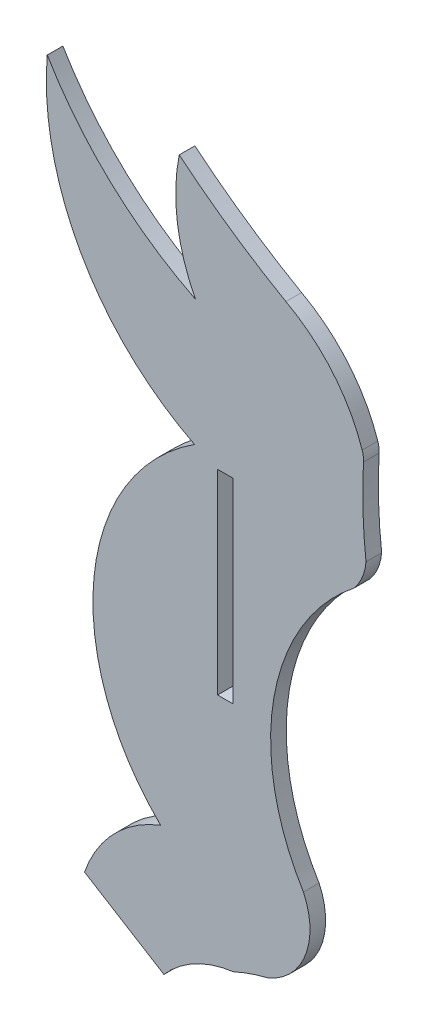
ISO-10303-21;
HEADER;
FILE_DESCRIPTION(('STEP AP214'),'2;1');
FILE_NAME('part.step','',(''),(''),'','','');
FILE_SCHEMA(('AUTOMOTIVE_DESIGN { 1 0 10303 214 1 1 1 1 }'));
ENDSEC;
DATA;
#1=APPLICATION_CONTEXT('core data for automotive mechanical design processes');
#2=APPLICATION_PROTOCOL_DEFINITION('international standard','automotive_design',2000,#1);
#3=PRODUCT_CONTEXT('',#1,'mechanical');
#4=PRODUCT('Part','Part','',(#3));
#5=PRODUCT_RELATED_PRODUCT_CATEGORY('part','',(#4));
#6=PRODUCT_DEFINITION_FORMATION('','',#4);
#7=PRODUCT_DEFINITION_CONTEXT('part definition',#1,'design');
#8=PRODUCT_DEFINITION('design','',#6,#7);
#9=PRODUCT_DEFINITION_SHAPE('','',#8);
#10=(LENGTH_UNIT() NAMED_UNIT(*) SI_UNIT(.MILLI.,.METRE.));
#11=(NAMED_UNIT(*) PLANE_ANGLE_UNIT() SI_UNIT($,.RADIAN.));
#12=(NAMED_UNIT(*) SI_UNIT($,.STERADIAN.) SOLID_ANGLE_UNIT());
#13=UNCERTAINTY_MEASURE_WITH_UNIT(LENGTH_MEASURE(1.E-05),#10,'distance_accuracy_value','');
#14=(GEOMETRIC_REPRESENTATION_CONTEXT(3) GLOBAL_UNCERTAINTY_ASSIGNED_CONTEXT((#13)) GLOBAL_UNIT_ASSIGNED_CONTEXT((#10,
#11,#12)) REPRESENTATION_CONTEXT('',''));
#15=CARTESIAN_POINT('',(0.,0.,0.));
#16=DIRECTION('',(0.,0.,1.));
#17=DIRECTION('',(1.,0.,0.));
#18=AXIS2_PLACEMENT_3D('',#15,#16,#17);
#19=CARTESIAN_POINT('',(9.55454090485293,-191.285070847435,1.524));
#20=DIRECTION('',(0.,0.,1.));
#21=DIRECTION('',(1.,0.,0.));
#22=AXIS2_PLACEMENT_3D('',#19,#20,#21);
#23=PLANE('',#22);
#24=CARTESIAN_POINT('',(9.55454090485293,-191.285070847435,1.524));
#25=DIRECTION('',(0.,0.,1.));
#26=DIRECTION('',(1.,0.,0.));
#27=AXIS2_PLACEMENT_3D('',#24,#25,#26);
#28=CIRCLE('',#27,21.7056422782127);
#29=CARTESIAN_POINT('',(-2.25421514068312,-173.072762169874,1.524));
#30=VERTEX_POINT('',#29);
#31=CARTESIAN_POINT('',(-5.54862103241916,-206.874471291527,1.524));
#32=VERTEX_POINT('',#31);
#33=EDGE_CURVE('E208',#30,#32,#28,.T.);
#34=ORIENTED_EDGE('',*,*,#33,.T.);
#35=CARTESIAN_POINT('',(-1.05625421100928,-218.650257011627,1.524));
#36=DIRECTION('',(0.,0.,1.));
#37=DIRECTION('',(1.,0.,0.));
#38=AXIS2_PLACEMENT_3D('',#35,#36,#37);
#39=CIRCLE('',#38,12.6035903211671);
#40=CARTESIAN_POINT('',(-12.9684016665908,-214.533069624551,1.524));
#41=VERTEX_POINT('',#40);
#42=EDGE_CURVE('E211',#32,#41,#39,.T.);
#43=ORIENTED_EDGE('',*,*,#42,.T.);
#44=DIRECTION('',(0.850986149629736,-0.525188131185728,0.));
#45=VECTOR('',#44,1.);
#46=CARTESIAN_POINT('',(-12.9684016665908,-214.533069624551,1.524));
#47=LINE('',#46,#45);
#48=CARTESIAN_POINT('',(-5.23100859896885,-219.308220203914,1.524));
#49=VERTEX_POINT('',#48);
#50=EDGE_CURVE('E214',#41,#49,#47,.T.);
#51=ORIENTED_EDGE('',*,*,#50,.T.);
#52=CARTESIAN_POINT('',(2.86907927883287,-226.347107534115,1.524));
#53=DIRECTION('',(0.,0.,-1.));
#54=DIRECTION('',(-1.,0.,0.));
#55=AXIS2_PLACEMENT_3D('',#52,#53,#54);
#56=CIRCLE('',#55,10.7311396633995);
#57=CARTESIAN_POINT('',(1.524,-215.700600115763,1.524));
#58=VERTEX_POINT('',#57);
#59=EDGE_CURVE('E216',#49,#58,#56,.T.);
#60=ORIENTED_EDGE('',*,*,#59,.T.);
#61=CARTESIAN_POINT('',(9.38357914118728,-232.915207817326,1.524));
#62=DIRECTION('',(0.,0.,-1.));
#63=DIRECTION('',(1.,0.,0.));
#64=AXIS2_PLACEMENT_3D('',#61,#62,#63);
#65=CIRCLE('',#64,18.9239452175096);
#66=CARTESIAN_POINT('',(4.91126657872368,-214.527328033649,1.524));
#67=VERTEX_POINT('',#66);
#68=EDGE_CURVE('E218',#58,#67,#65,.T.);
#69=ORIENTED_EDGE('',*,*,#68,.T.);
#70=CARTESIAN_POINT('',(2.37198795819861,-208.395239811144,1.524));
#71=DIRECTION('',(0.,0.,1.));
#72=DIRECTION('',(-1.,0.,0.));
#73=AXIS2_PLACEMENT_3D('',#70,#71,#72);
#74=CIRCLE('',#73,6.6370506914778);
#75=CARTESIAN_POINT('',(8.36625056807073,-205.545808702109,1.524));
#76=VERTEX_POINT('',#75);
#77=EDGE_CURVE('E220',#67,#76,#74,.T.);
#78=ORIENTED_EDGE('',*,*,#77,.T.);
#79=CARTESIAN_POINT('',(26.6766710158399,-194.264083119774,1.524));
#80=DIRECTION('',(0.,0.,-1.));
#81=DIRECTION('',(1.,0.,0.));
#82=AXIS2_PLACEMENT_3D('',#79,#80,#81);
#83=CIRCLE('',#82,21.5069483909083);
#84=CARTESIAN_POINT('',(13.311403321465,-177.414203341364,1.524));
#85=VERTEX_POINT('',#84);
#86=EDGE_CURVE('E222',#76,#85,#83,.T.);
#87=ORIENTED_EDGE('',*,*,#86,.T.);
#88=CARTESIAN_POINT('',(9.55284362416045,-174.220966814507,1.524));
#89=DIRECTION('',(0.,0.,1.));
#90=DIRECTION('',(-1.,0.,0.));
#91=AXIS2_PLACEMENT_3D('',#88,#89,#90);
#92=CIRCLE('',#91,4.93188914257543);
#93=CARTESIAN_POINT('',(14.4684042680743,-174.621958174337,1.524));
#94=VERTEX_POINT('',#93);
#95=EDGE_CURVE('E224',#85,#94,#92,.T.);
#96=ORIENTED_EDGE('',*,*,#95,.T.);
#97=CARTESIAN_POINT('',(63.0675660835449,-169.034269570961,1.524));
#98=DIRECTION('',(0.,0.,-1.));
#99=DIRECTION('',(1.,0.,0.));
#100=AXIS2_PLACEMENT_3D('',#97,#98,#99);
#101=CIRCLE('',#100,48.9193294424054);
#102=CARTESIAN_POINT('',(14.2231544027315,-166.327936138102,1.524));
#103=VERTEX_POINT('',#102);
#104=EDGE_CURVE('E226',#94,#103,#101,.T.);
#105=ORIENTED_EDGE('',*,*,#104,.T.);
#106=CARTESIAN_POINT('',(11.6870442989508,-166.187417308476,1.524));
#107=DIRECTION('',(0.,0.,1.));
#108=DIRECTION('',(1.,0.,0.));
#109=AXIS2_PLACEMENT_3D('',#106,#107,#108);
#110=CIRCLE('',#109,2.53999999999569);
#111=CARTESIAN_POINT('',(14.0945005026069,-165.377630529468,1.524));
#112=VERTEX_POINT('',#111);
#113=EDGE_CURVE('E228',#103,#112,#110,.T.);
#114=ORIENTED_EDGE('',*,*,#113,.T.);
#115=CARTESIAN_POINT('',(-0.795742059192087,-170.38620412032,1.524));
#116=DIRECTION('',(0.,0.,1.));
#117=DIRECTION('',(-1.,0.,0.));
#118=AXIS2_PLACEMENT_3D('',#115,#116,#117);
#119=CIRCLE('',#118,15.7100328759741);
#120=CARTESIAN_POINT('',(6.66463399306851,-156.560578560402,1.524));
#121=VERTEX_POINT('',#120);
#122=EDGE_CURVE('E230',#112,#121,#119,.T.);
#123=ORIENTED_EDGE('',*,*,#122,.T.);
#124=CARTESIAN_POINT('',(43.2467626277982,-92.4867373333111,1.524));
#125=DIRECTION('',(0.,0.,-1.));
#126=DIRECTION('',(1.,0.,0.));
#127=AXIS2_PLACEMENT_3D('',#124,#125,#126);
#128=CIRCLE('',#127,73.7814967660752);
#129=CARTESIAN_POINT('',(-3.73848602777618,-149.373428868469,1.524));
#130=VERTEX_POINT('',#129);
#131=EDGE_CURVE('E232',#121,#130,#128,.T.);
#132=ORIENTED_EDGE('',*,*,#131,.T.);
#133=CARTESIAN_POINT('',(13.3536544556553,-152.814995018638,1.524));
#134=DIRECTION('',(0.,0.,1.));
#135=DIRECTION('',(-1.,0.,0.));
#136=AXIS2_PLACEMENT_3D('',#133,#134,#135);
#137=CIRCLE('',#136,17.4351840790783);
#138=CARTESIAN_POINT('',(-2.16496753200634,-160.762196757326,1.524));
#139=VERTEX_POINT('',#138);
#140=EDGE_CURVE('E234',#130,#139,#137,.T.);
#141=ORIENTED_EDGE('',*,*,#140,.T.);
#142=CARTESIAN_POINT('',(13.3465831148694,-129.548919544681,1.524));
#143=DIRECTION('',(0.,0.,-1.));
#144=DIRECTION('',(1.,0.,0.));
#145=AXIS2_PLACEMENT_3D('',#142,#143,#144);
#146=CIRCLE('',#145,34.8550839595031);
#147=CARTESIAN_POINT('',(-16.6028780585245,-147.37885653973,1.524));
#148=VERTEX_POINT('',#147);
#149=EDGE_CURVE('E236',#139,#148,#146,.T.);
#150=ORIENTED_EDGE('',*,*,#149,.T.);
#151=CARTESIAN_POINT('',(9.66197196981243,-149.564782579722,1.524));
#152=DIRECTION('',(0.,0.,1.));
#153=DIRECTION('',(-1.,0.,0.));
#154=AXIS2_PLACEMENT_3D('',#151,#152,#153);
#155=CIRCLE('',#154,26.3556563125138);
#156=EDGE_CURVE('E238',#148,#30,#155,.T.);
#157=ORIENTED_EDGE('',*,*,#156,.T.);
#158=EDGE_LOOP('',(#34,#43,#51,#60,#69,#78,#87,#96,#105,#114,#123,#132,#141,#150,#157));
#159=FACE_BOUND('',#158,.T.);
#160=DIRECTION('',(-1.,0.,0.));
#161=VECTOR('',#160,1.);
#162=CARTESIAN_POINT('',(1.52400000000001,-174.049694422532,1.524));
#163=LINE('',#162,#161);
#164=CARTESIAN_POINT('',(1.52400000000001,-174.049694422532,1.524));
#165=VERTEX_POINT('',#164);
#166=CARTESIAN_POINT('',(0.,-174.049694422532,1.524));
#167=VERTEX_POINT('',#166);
#168=EDGE_CURVE('E180',#165,#167,#163,.T.);
#169=ORIENTED_EDGE('',*,*,#168,.F.);
#170=DIRECTION('',(0.,1.,0.));
#171=VECTOR('',#170,1.);
#172=CARTESIAN_POINT('',(1.52400000000001,-174.049694422532,1.524));
#173=LINE('',#172,#171);
#174=CARTESIAN_POINT('',(1.52400000000001,-193.099694422531,1.524));
#175=VERTEX_POINT('',#174);
#176=EDGE_CURVE('E172',#175,#165,#173,.T.);
#177=ORIENTED_EDGE('',*,*,#176,.F.);
#178=DIRECTION('',(1.,0.,0.));
#179=VECTOR('',#178,1.);
#180=CARTESIAN_POINT('',(1.52400000000001,-193.099694422531,1.524));
#181=LINE('',#180,#179);
#182=CARTESIAN_POINT('',(0.,-193.099694422531,1.524));
#183=VERTEX_POINT('',#182);
#184=EDGE_CURVE('E194',#183,#175,#181,.T.);
#185=ORIENTED_EDGE('',*,*,#184,.F.);
#186=DIRECTION('',(0.,-1.,0.));
#187=VECTOR('',#186,1.);
#188=CARTESIAN_POINT('',(0.,-174.049694422532,1.524));
#189=LINE('',#188,#187);
#190=EDGE_CURVE('E192',#167,#183,#189,.T.);
#191=ORIENTED_EDGE('',*,*,#190,.F.);
#192=EDGE_LOOP('',(#169,#177,#185,#191));
#193=FACE_BOUND('',#192,.T.);
#194=ADVANCED_FACE('F41',(#159,#193),#23,.T.);
#195=CARTESIAN_POINT('',(9.55454090485293,-191.285070847435,0.));
#196=DIRECTION('',(0.,0.,1.));
#197=DIRECTION('',(1.,0.,0.));
#198=AXIS2_PLACEMENT_3D('',#195,#196,#197);
#199=PLANE('',#198);
#200=CARTESIAN_POINT('',(9.55454090485293,-191.285070847435,0.));
#201=DIRECTION('',(0.,0.,1.));
#202=DIRECTION('',(1.,0.,0.));
#203=AXIS2_PLACEMENT_3D('',#200,#201,#202);
#204=CIRCLE('',#203,21.7056422782127);
#205=CARTESIAN_POINT('',(-2.25421514068312,-173.072762169874,0.));
#206=VERTEX_POINT('',#205);
#207=CARTESIAN_POINT('',(-5.54862103241916,-206.874471291527,0.));
#208=VERTEX_POINT('',#207);
#209=EDGE_CURVE('E188',#206,#208,#204,.T.);
#210=ORIENTED_EDGE('',*,*,#209,.F.);
#211=CARTESIAN_POINT('',(9.66197196981243,-149.564782579722,0.));
#212=DIRECTION('',(0.,0.,1.));
#213=DIRECTION('',(-1.,0.,0.));
#214=AXIS2_PLACEMENT_3D('',#211,#212,#213);
#215=CIRCLE('',#214,26.3556563125138);
#216=CARTESIAN_POINT('',(-16.6028780585245,-147.37885653973,0.));
#217=VERTEX_POINT('',#216);
#218=EDGE_CURVE('E212',#217,#206,#215,.T.);
#219=ORIENTED_EDGE('',*,*,#218,.F.);
#220=CARTESIAN_POINT('',(13.3465831148694,-129.548919544681,0.));
#221=DIRECTION('',(0.,0.,-1.));
#222=DIRECTION('',(1.,0.,0.));
#223=AXIS2_PLACEMENT_3D('',#220,#221,#222);
#224=CIRCLE('',#223,34.8550839595031);
#225=CARTESIAN_POINT('',(-2.16496753200634,-160.762196757326,0.));
#226=VERTEX_POINT('',#225);
#227=EDGE_CURVE('E267',#226,#217,#224,.T.);
#228=ORIENTED_EDGE('',*,*,#227,.F.);
#229=CARTESIAN_POINT('',(13.3536544556553,-152.814995018638,0.));
#230=DIRECTION('',(0.,0.,1.));
#231=DIRECTION('',(-1.,0.,0.));
#232=AXIS2_PLACEMENT_3D('',#229,#230,#231);
#233=CIRCLE('',#232,17.4351840790783);
#234=CARTESIAN_POINT('',(-3.73848602777618,-149.373428868469,0.));
#235=VERTEX_POINT('',#234);
#236=EDGE_CURVE('E265',#235,#226,#233,.T.);
#237=ORIENTED_EDGE('',*,*,#236,.F.);
#238=CARTESIAN_POINT('',(43.2467626277982,-92.4867373333111,0.));
#239=DIRECTION('',(0.,0.,-1.));
#240=DIRECTION('',(1.,0.,0.));
#241=AXIS2_PLACEMENT_3D('',#238,#239,#240);
#242=CIRCLE('',#241,73.7814967660752);
#243=CARTESIAN_POINT('',(6.66463399306851,-156.560578560402,0.));
#244=VERTEX_POINT('',#243);
#245=EDGE_CURVE('E263',#244,#235,#242,.T.);
#246=ORIENTED_EDGE('',*,*,#245,.F.);
#247=CARTESIAN_POINT('',(-0.795742059192087,-170.38620412032,0.));
#248=DIRECTION('',(0.,0.,1.));
#249=DIRECTION('',(-1.,0.,0.));
#250=AXIS2_PLACEMENT_3D('',#247,#248,#249);
#251=CIRCLE('',#250,15.7100328759741);
#252=CARTESIAN_POINT('',(14.0945005026069,-165.377630529468,0.));
#253=VERTEX_POINT('',#252);
#254=EDGE_CURVE('E261',#253,#244,#251,.T.);
#255=ORIENTED_EDGE('',*,*,#254,.F.);
#256=CARTESIAN_POINT('',(11.6870442989508,-166.187417308476,0.));
#257=DIRECTION('',(0.,0.,1.));
#258=DIRECTION('',(1.,0.,0.));
#259=AXIS2_PLACEMENT_3D('',#256,#257,#258);
#260=CIRCLE('',#259,2.53999999999569);
#261=CARTESIAN_POINT('',(14.2231544027315,-166.327936138102,0.));
#262=VERTEX_POINT('',#261);
#263=EDGE_CURVE('E259',#262,#253,#260,.T.);
#264=ORIENTED_EDGE('',*,*,#263,.F.);
#265=CARTESIAN_POINT('',(63.0675660835449,-169.034269570961,0.));
#266=DIRECTION('',(0.,0.,-1.));
#267=DIRECTION('',(1.,0.,0.));
#268=AXIS2_PLACEMENT_3D('',#265,#266,#267);
#269=CIRCLE('',#268,48.9193294424054);
#270=CARTESIAN_POINT('',(14.4684042680743,-174.621958174337,0.));
#271=VERTEX_POINT('',#270);
#272=EDGE_CURVE('E257',#271,#262,#269,.T.);
#273=ORIENTED_EDGE('',*,*,#272,.F.);
#274=CARTESIAN_POINT('',(9.55284362416045,-174.220966814507,0.));
#275=DIRECTION('',(0.,0.,1.));
#276=DIRECTION('',(-1.,0.,0.));
#277=AXIS2_PLACEMENT_3D('',#274,#275,#276);
#278=CIRCLE('',#277,4.93188914257543);
#279=CARTESIAN_POINT('',(13.311403321465,-177.414203341364,0.));
#280=VERTEX_POINT('',#279);
#281=EDGE_CURVE('E255',#280,#271,#278,.T.);
#282=ORIENTED_EDGE('',*,*,#281,.F.);
#283=CARTESIAN_POINT('',(26.6766710158399,-194.264083119774,0.));
#284=DIRECTION('',(0.,0.,-1.));
#285=DIRECTION('',(1.,0.,0.));
#286=AXIS2_PLACEMENT_3D('',#283,#284,#285);
#287=CIRCLE('',#286,21.5069483909083);
#288=CARTESIAN_POINT('',(8.36625056807073,-205.545808702109,0.));
#289=VERTEX_POINT('',#288);
#290=EDGE_CURVE('E253',#289,#280,#287,.T.);
#291=ORIENTED_EDGE('',*,*,#290,.F.);
#292=CARTESIAN_POINT('',(2.37198795819861,-208.395239811144,0.));
#293=DIRECTION('',(0.,0.,1.));
#294=DIRECTION('',(-1.,0.,0.));
#295=AXIS2_PLACEMENT_3D('',#292,#293,#294);
#296=CIRCLE('',#295,6.6370506914778);
#297=CARTESIAN_POINT('',(4.91126657872368,-214.527328033649,0.));
#298=VERTEX_POINT('',#297);
#299=EDGE_CURVE('E251',#298,#289,#296,.T.);
#300=ORIENTED_EDGE('',*,*,#299,.F.);
#301=CARTESIAN_POINT('',(9.38357914118728,-232.915207817326,0.));
#302=DIRECTION('',(0.,0.,-1.));
#303=DIRECTION('',(1.,0.,0.));
#304=AXIS2_PLACEMENT_3D('',#301,#302,#303);
#305=CIRCLE('',#304,18.9239452175096);
#306=CARTESIAN_POINT('',(1.524,-215.700600115763,0.));
#307=VERTEX_POINT('',#306);
#308=EDGE_CURVE('E249',#307,#298,#305,.T.);
#309=ORIENTED_EDGE('',*,*,#308,.F.);
#310=CARTESIAN_POINT('',(2.86907927883287,-226.347107534115,0.));
#311=DIRECTION('',(0.,0.,-1.));
#312=DIRECTION('',(-1.,0.,0.));
#313=AXIS2_PLACEMENT_3D('',#310,#311,#312);
#314=CIRCLE('',#313,10.7311396633995);
#315=CARTESIAN_POINT('',(-5.23100859896885,-219.308220203914,0.));
#316=VERTEX_POINT('',#315);
#317=EDGE_CURVE('E247',#316,#307,#314,.T.);
#318=ORIENTED_EDGE('',*,*,#317,.F.);
#319=DIRECTION('',(0.850986149629736,-0.525188131185728,0.));
#320=VECTOR('',#319,1.);
#321=CARTESIAN_POINT('',(-12.9684016665908,-214.533069624551,0.));
#322=LINE('',#321,#320);
#323=CARTESIAN_POINT('',(-12.9684016665908,-214.533069624551,0.));
#324=VERTEX_POINT('',#323);
#325=EDGE_CURVE('E245',#324,#316,#322,.T.);
#326=ORIENTED_EDGE('',*,*,#325,.F.);
#327=CARTESIAN_POINT('',(-1.05625421100928,-218.650257011627,0.));
#328=DIRECTION('',(0.,0.,1.));
#329=DIRECTION('',(1.,0.,0.));
#330=AXIS2_PLACEMENT_3D('',#327,#328,#329);
#331=CIRCLE('',#330,12.6035903211671);
#332=EDGE_CURVE('E243',#208,#324,#331,.T.);
#333=ORIENTED_EDGE('',*,*,#332,.F.);
#334=EDGE_LOOP('',(#210,#219,#228,#237,#246,#255,#264,#273,#282,#291,#300,#309,#318,#326,#333));
#335=FACE_BOUND('',#334,.T.);
#336=DIRECTION('',(0.,1.,0.));
#337=VECTOR('',#336,1.);
#338=CARTESIAN_POINT('',(1.52400000000001,-174.049694422532,0.));
#339=LINE('',#338,#337);
#340=CARTESIAN_POINT('',(1.52400000000001,-193.099694422531,0.));
#341=VERTEX_POINT('',#340);
#342=CARTESIAN_POINT('',(1.52400000000001,-174.049694422532,0.));
#343=VERTEX_POINT('',#342);
#344=EDGE_CURVE('E64',#341,#343,#339,.T.);
#345=ORIENTED_EDGE('',*,*,#344,.T.);
#346=DIRECTION('',(-1.,0.,0.));
#347=VECTOR('',#346,1.);
#348=CARTESIAN_POINT('',(1.52400000000001,-174.049694422532,0.));
#349=LINE('',#348,#347);
#350=CARTESIAN_POINT('',(0.,-174.049694422532,0.));
#351=VERTEX_POINT('',#350);
#352=EDGE_CURVE('E187',#343,#351,#349,.T.);
#353=ORIENTED_EDGE('',*,*,#352,.T.);
#354=DIRECTION('',(0.,-1.,0.));
#355=VECTOR('',#354,1.);
#356=CARTESIAN_POINT('',(0.,-174.049694422532,0.));
#357=LINE('',#356,#355);
#358=CARTESIAN_POINT('',(0.,-193.099694422531,0.));
#359=VERTEX_POINT('',#358);
#360=EDGE_CURVE('E200',#351,#359,#357,.T.);
#361=ORIENTED_EDGE('',*,*,#360,.T.);
#362=DIRECTION('',(1.,0.,0.));
#363=VECTOR('',#362,1.);
#364=CARTESIAN_POINT('',(1.52400000000001,-193.099694422531,0.));
#365=LINE('',#364,#363);
#366=EDGE_CURVE('E181',#359,#341,#365,.T.);
#367=ORIENTED_EDGE('',*,*,#366,.T.);
#368=EDGE_LOOP('',(#345,#353,#361,#367));
#369=FACE_BOUND('',#368,.T.);
#370=ADVANCED_FACE('F318',(#335,#369),#199,.F.);
#371=CARTESIAN_POINT('',(9.55454090485293,-191.285070847435,1.524));
#372=DIRECTION('',(0.,0.,-1.));
#373=DIRECTION('',(-1.,0.,0.));
#374=AXIS2_PLACEMENT_3D('',#371,#372,#373);
#375=CYLINDRICAL_SURFACE('',#374,21.7056422782127);
#376=ORIENTED_EDGE('',*,*,#209,.T.);
#377=DIRECTION('',(0.,0.,-1.));
#378=VECTOR('',#377,1.);
#379=CARTESIAN_POINT('',(-5.54862103241916,-206.874471291527,1.524));
#380=LINE('',#379,#378);
#381=EDGE_CURVE('E11',#32,#208,#380,.T.);
#382=ORIENTED_EDGE('',*,*,#381,.F.);
#383=ORIENTED_EDGE('',*,*,#33,.F.);
#384=DIRECTION('',(0.,0.,-1.));
#385=VECTOR('',#384,1.);
#386=CARTESIAN_POINT('',(-2.25421514068312,-173.072762169874,1.524));
#387=LINE('',#386,#385);
#388=EDGE_CURVE('E240',#30,#206,#387,.T.);
#389=ORIENTED_EDGE('',*,*,#388,.T.);
#390=EDGE_LOOP('',(#376,#382,#383,#389));
#391=FACE_BOUND('',#390,.T.);
#392=ADVANCED_FACE('F43',(#391),#375,.T.);
#393=CARTESIAN_POINT('',(-1.05625421100928,-218.650257011627,1.524));
#394=DIRECTION('',(0.,0.,-1.));
#395=DIRECTION('',(-1.,0.,0.));
#396=AXIS2_PLACEMENT_3D('',#393,#394,#395);
#397=CYLINDRICAL_SURFACE('',#396,12.6035903211671);
#398=ORIENTED_EDGE('',*,*,#332,.T.);
#399=DIRECTION('',(0.,0.,-1.));
#400=VECTOR('',#399,1.);
#401=CARTESIAN_POINT('',(-12.9684016665908,-214.533069624551,1.524));
#402=LINE('',#401,#400);
#403=EDGE_CURVE('E49',#41,#324,#402,.T.);
#404=ORIENTED_EDGE('',*,*,#403,.F.);
#405=ORIENTED_EDGE('',*,*,#42,.F.);
#406=ORIENTED_EDGE('',*,*,#381,.T.);
#407=EDGE_LOOP('',(#398,#404,#405,#406));
#408=FACE_BOUND('',#407,.T.);
#409=ADVANCED_FACE('F335',(#408),#397,.T.);
#410=CARTESIAN_POINT('',(-12.9684016665908,-214.533069624551,1.524));
#411=DIRECTION('',(0.525188131185728,0.850986149629736,0.));
#412=DIRECTION('',(-0.850986149629736,0.525188131185728,0.));
#413=AXIS2_PLACEMENT_3D('',#410,#411,#412);
#414=PLANE('',#413);
#415=ORIENTED_EDGE('',*,*,#325,.T.);
#416=DIRECTION('',(0.,0.,-1.));
#417=VECTOR('',#416,1.);
#418=CARTESIAN_POINT('',(-5.23100859896885,-219.308220203914,1.524));
#419=LINE('',#418,#417);
#420=EDGE_CURVE('E305',#49,#316,#419,.T.);
#421=ORIENTED_EDGE('',*,*,#420,.F.);
#422=ORIENTED_EDGE('',*,*,#50,.F.);
#423=ORIENTED_EDGE('',*,*,#403,.T.);
#424=EDGE_LOOP('',(#415,#421,#422,#423));
#425=FACE_BOUND('',#424,.T.);
#426=ADVANCED_FACE('F312',(#425),#414,.F.);
#427=CARTESIAN_POINT('',(2.86907927883287,-226.347107534115,1.524));
#428=DIRECTION('',(0.,0.,-1.));
#429=DIRECTION('',(-1.,0.,0.));
#430=AXIS2_PLACEMENT_3D('',#427,#428,#429);
#431=CYLINDRICAL_SURFACE('',#430,10.7311396633995);
#432=ORIENTED_EDGE('',*,*,#317,.T.);
#433=DIRECTION('',(0.,0.,-1.));
#434=VECTOR('',#433,1.);
#435=CARTESIAN_POINT('',(1.524,-215.700600115763,1.524));
#436=LINE('',#435,#434);
#437=EDGE_CURVE('E302',#58,#307,#436,.T.);
#438=ORIENTED_EDGE('',*,*,#437,.F.);
#439=ORIENTED_EDGE('',*,*,#59,.F.);
#440=ORIENTED_EDGE('',*,*,#420,.T.);
#441=EDGE_LOOP('',(#432,#438,#439,#440));
#442=FACE_BOUND('',#441,.T.);
#443=ADVANCED_FACE('F324',(#442),#431,.F.);
#444=CARTESIAN_POINT('',(9.38357914118728,-232.915207817326,1.524));
#445=DIRECTION('',(0.,0.,-1.));
#446=DIRECTION('',(-1.,0.,0.));
#447=AXIS2_PLACEMENT_3D('',#444,#445,#446);
#448=CYLINDRICAL_SURFACE('',#447,18.9239452175096);
#449=ORIENTED_EDGE('',*,*,#308,.T.);
#450=DIRECTION('',(0.,0.,-1.));
#451=VECTOR('',#450,1.);
#452=CARTESIAN_POINT('',(4.91126657872368,-214.527328033649,1.524));
#453=LINE('',#452,#451);
#454=EDGE_CURVE('E299',#67,#298,#453,.T.);
#455=ORIENTED_EDGE('',*,*,#454,.F.);
#456=ORIENTED_EDGE('',*,*,#68,.F.);
#457=ORIENTED_EDGE('',*,*,#437,.T.);
#458=EDGE_LOOP('',(#449,#455,#456,#457));
#459=FACE_BOUND('',#458,.T.);
#460=ADVANCED_FACE('F328',(#459),#448,.F.);
#461=CARTESIAN_POINT('',(2.37198795819861,-208.395239811144,1.524));
#462=DIRECTION('',(0.,0.,-1.));
#463=DIRECTION('',(-1.,0.,0.));
#464=AXIS2_PLACEMENT_3D('',#461,#462,#463);
#465=CYLINDRICAL_SURFACE('',#464,6.6370506914778);
#466=ORIENTED_EDGE('',*,*,#299,.T.);
#467=DIRECTION('',(0.,0.,-1.));
#468=VECTOR('',#467,1.);
#469=CARTESIAN_POINT('',(8.36625056807073,-205.545808702109,1.524));
#470=LINE('',#469,#468);
#471=EDGE_CURVE('E296',#76,#289,#470,.T.);
#472=ORIENTED_EDGE('',*,*,#471,.F.);
#473=ORIENTED_EDGE('',*,*,#77,.F.);
#474=ORIENTED_EDGE('',*,*,#454,.T.);
#475=EDGE_LOOP('',(#466,#472,#473,#474));
#476=FACE_BOUND('',#475,.T.);
#477=ADVANCED_FACE('F383',(#476),#465,.T.);
#478=CARTESIAN_POINT('',(26.6766710158399,-194.264083119774,1.524));
#479=DIRECTION('',(0.,0.,-1.));
#480=DIRECTION('',(-1.,0.,0.));
#481=AXIS2_PLACEMENT_3D('',#478,#479,#480);
#482=CYLINDRICAL_SURFACE('',#481,21.5069483909083);
#483=ORIENTED_EDGE('',*,*,#290,.T.);
#484=DIRECTION('',(0.,0.,-1.));
#485=VECTOR('',#484,1.);
#486=CARTESIAN_POINT('',(13.311403321465,-177.414203341364,1.524));
#487=LINE('',#486,#485);
#488=EDGE_CURVE('E293',#85,#280,#487,.T.);
#489=ORIENTED_EDGE('',*,*,#488,.F.);
#490=ORIENTED_EDGE('',*,*,#86,.F.);
#491=ORIENTED_EDGE('',*,*,#471,.T.);
#492=EDGE_LOOP('',(#483,#489,#490,#491));
#493=FACE_BOUND('',#492,.T.);
#494=ADVANCED_FACE('F381',(#493),#482,.F.);
#495=CARTESIAN_POINT('',(9.55284362416045,-174.220966814507,1.524));
#496=DIRECTION('',(0.,0.,-1.));
#497=DIRECTION('',(-1.,0.,0.));
#498=AXIS2_PLACEMENT_3D('',#495,#496,#497);
#499=CYLINDRICAL_SURFACE('',#498,4.93188914257543);
#500=ORIENTED_EDGE('',*,*,#281,.T.);
#501=DIRECTION('',(0.,0.,-1.));
#502=VECTOR('',#501,1.);
#503=CARTESIAN_POINT('',(14.4684042680743,-174.621958174337,1.524));
#504=LINE('',#503,#502);
#505=EDGE_CURVE('E290',#94,#271,#504,.T.);
#506=ORIENTED_EDGE('',*,*,#505,.F.);
#507=ORIENTED_EDGE('',*,*,#95,.F.);
#508=ORIENTED_EDGE('',*,*,#488,.T.);
#509=EDGE_LOOP('',(#500,#506,#507,#508));
#510=FACE_BOUND('',#509,.T.);
#511=ADVANCED_FACE('F377',(#510),#499,.T.);
#512=CARTESIAN_POINT('',(63.0675660835449,-169.034269570961,1.524));
#513=DIRECTION('',(0.,0.,-1.));
#514=DIRECTION('',(-1.,0.,0.));
#515=AXIS2_PLACEMENT_3D('',#512,#513,#514);
#516=CYLINDRICAL_SURFACE('',#515,48.9193294424054);
#517=ORIENTED_EDGE('',*,*,#272,.T.);
#518=DIRECTION('',(0.,0.,-1.));
#519=VECTOR('',#518,1.);
#520=CARTESIAN_POINT('',(14.2231544027315,-166.327936138102,1.524));
#521=LINE('',#520,#519);
#522=EDGE_CURVE('E287',#103,#262,#521,.T.);
#523=ORIENTED_EDGE('',*,*,#522,.F.);
#524=ORIENTED_EDGE('',*,*,#104,.F.);
#525=ORIENTED_EDGE('',*,*,#505,.T.);
#526=EDGE_LOOP('',(#517,#523,#524,#525));
#527=FACE_BOUND('',#526,.T.);
#528=ADVANCED_FACE('F372',(#527),#516,.F.);
#529=CARTESIAN_POINT('',(11.6870442989508,-166.187417308476,1.524));
#530=DIRECTION('',(0.,0.,-1.));
#531=DIRECTION('',(-1.,0.,0.));
#532=AXIS2_PLACEMENT_3D('',#529,#530,#531);
#533=CYLINDRICAL_SURFACE('',#532,2.53999999999569);
#534=ORIENTED_EDGE('',*,*,#263,.T.);
#535=DIRECTION('',(0.,0.,-1.));
#536=VECTOR('',#535,1.);
#537=CARTESIAN_POINT('',(14.0945005026069,-165.377630529468,1.524));
#538=LINE('',#537,#536);
#539=EDGE_CURVE('E284',#112,#253,#538,.T.);
#540=ORIENTED_EDGE('',*,*,#539,.F.);
#541=ORIENTED_EDGE('',*,*,#113,.F.);
#542=ORIENTED_EDGE('',*,*,#522,.T.);
#543=EDGE_LOOP('',(#534,#540,#541,#542));
#544=FACE_BOUND('',#543,.T.);
#545=ADVANCED_FACE('F366',(#544),#533,.T.);
#546=CARTESIAN_POINT('',(-0.795742059192087,-170.38620412032,1.524));
#547=DIRECTION('',(0.,0.,-1.));
#548=DIRECTION('',(-1.,0.,0.));
#549=AXIS2_PLACEMENT_3D('',#546,#547,#548);
#550=CYLINDRICAL_SURFACE('',#549,15.7100328759741);
#551=ORIENTED_EDGE('',*,*,#254,.T.);
#552=DIRECTION('',(0.,0.,-1.));
#553=VECTOR('',#552,1.);
#554=CARTESIAN_POINT('',(6.66463399306851,-156.560578560402,1.524));
#555=LINE('',#554,#553);
#556=EDGE_CURVE('E281',#121,#244,#555,.T.);
#557=ORIENTED_EDGE('',*,*,#556,.F.);
#558=ORIENTED_EDGE('',*,*,#122,.F.);
#559=ORIENTED_EDGE('',*,*,#539,.T.);
#560=EDGE_LOOP('',(#551,#557,#558,#559));
#561=FACE_BOUND('',#560,.T.);
#562=ADVANCED_FACE('F362',(#561),#550,.T.);
#563=CARTESIAN_POINT('',(43.2467626277982,-92.4867373333111,1.524));
#564=DIRECTION('',(0.,0.,-1.));
#565=DIRECTION('',(-1.,0.,0.));
#566=AXIS2_PLACEMENT_3D('',#563,#564,#565);
#567=CYLINDRICAL_SURFACE('',#566,73.7814967660752);
#568=ORIENTED_EDGE('',*,*,#245,.T.);
#569=DIRECTION('',(0.,0.,-1.));
#570=VECTOR('',#569,1.);
#571=CARTESIAN_POINT('',(-3.73848602777618,-149.373428868469,1.524));
#572=LINE('',#571,#570);
#573=EDGE_CURVE('E278',#130,#235,#572,.T.);
#574=ORIENTED_EDGE('',*,*,#573,.F.);
#575=ORIENTED_EDGE('',*,*,#131,.F.);
#576=ORIENTED_EDGE('',*,*,#556,.T.);
#577=EDGE_LOOP('',(#568,#574,#575,#576));
#578=FACE_BOUND('',#577,.T.);
#579=ADVANCED_FACE('F357',(#578),#567,.F.);
#580=CARTESIAN_POINT('',(13.3536544556553,-152.814995018638,1.524));
#581=DIRECTION('',(0.,0.,-1.));
#582=DIRECTION('',(-1.,0.,0.));
#583=AXIS2_PLACEMENT_3D('',#580,#581,#582);
#584=CYLINDRICAL_SURFACE('',#583,17.4351840790783);
#585=ORIENTED_EDGE('',*,*,#236,.T.);
#586=DIRECTION('',(0.,0.,-1.));
#587=VECTOR('',#586,1.);
#588=CARTESIAN_POINT('',(-2.16496753200634,-160.762196757326,1.524));
#589=LINE('',#588,#587);
#590=EDGE_CURVE('E275',#139,#226,#589,.T.);
#591=ORIENTED_EDGE('',*,*,#590,.F.);
#592=ORIENTED_EDGE('',*,*,#140,.F.);
#593=ORIENTED_EDGE('',*,*,#573,.T.);
#594=EDGE_LOOP('',(#585,#591,#592,#593));
#595=FACE_BOUND('',#594,.T.);
#596=ADVANCED_FACE('F351',(#595),#584,.T.);
#597=CARTESIAN_POINT('',(13.3465831148694,-129.548919544681,1.524));
#598=DIRECTION('',(0.,0.,-1.));
#599=DIRECTION('',(-1.,0.,0.));
#600=AXIS2_PLACEMENT_3D('',#597,#598,#599);
#601=CYLINDRICAL_SURFACE('',#600,34.8550839595031);
#602=ORIENTED_EDGE('',*,*,#227,.T.);
#603=DIRECTION('',(0.,0.,-1.));
#604=VECTOR('',#603,1.);
#605=CARTESIAN_POINT('',(-16.6028780585245,-147.37885653973,1.524));
#606=LINE('',#605,#604);
#607=EDGE_CURVE('E272',#148,#217,#606,.T.);
#608=ORIENTED_EDGE('',*,*,#607,.F.);
#609=ORIENTED_EDGE('',*,*,#149,.F.);
#610=ORIENTED_EDGE('',*,*,#590,.T.);
#611=EDGE_LOOP('',(#602,#608,#609,#610));
#612=FACE_BOUND('',#611,.T.);
#613=ADVANCED_FACE('F347',(#612),#601,.F.);
#614=CARTESIAN_POINT('',(9.66197196981243,-149.564782579722,1.524));
#615=DIRECTION('',(0.,0.,-1.));
#616=DIRECTION('',(-1.,0.,0.));
#617=AXIS2_PLACEMENT_3D('',#614,#615,#616);
#618=CYLINDRICAL_SURFACE('',#617,26.3556563125138);
#619=ORIENTED_EDGE('',*,*,#218,.T.);
#620=ORIENTED_EDGE('',*,*,#388,.F.);
#621=ORIENTED_EDGE('',*,*,#156,.F.);
#622=ORIENTED_EDGE('',*,*,#607,.T.);
#623=EDGE_LOOP('',(#619,#620,#621,#622));
#624=FACE_BOUND('',#623,.T.);
#625=ADVANCED_FACE('F342',(#624),#618,.T.);
#626=CARTESIAN_POINT('',(1.52400000000001,-174.049694422532,1.524));
#627=DIRECTION('',(-1.,0.,0.));
#628=DIRECTION('',(0.,0.,1.));
#629=AXIS2_PLACEMENT_3D('',#626,#627,#628);
#630=PLANE('',#629);
#631=ORIENTED_EDGE('',*,*,#344,.F.);
#632=DIRECTION('',(0.,0.,-1.));
#633=VECTOR('',#632,1.);
#634=CARTESIAN_POINT('',(1.52400000000001,-193.099694422531,1.524));
#635=LINE('',#634,#633);
#636=EDGE_CURVE('E176',#175,#341,#635,.T.);
#637=ORIENTED_EDGE('',*,*,#636,.F.);
#638=ORIENTED_EDGE('',*,*,#176,.T.);
#639=DIRECTION('',(0.,0.,-1.));
#640=VECTOR('',#639,1.);
#641=CARTESIAN_POINT('',(1.52400000000001,-174.049694422532,1.524));
#642=LINE('',#641,#640);
#643=EDGE_CURVE('E175',#165,#343,#642,.T.);
#644=ORIENTED_EDGE('',*,*,#643,.T.);
#645=EDGE_LOOP('',(#631,#637,#638,#644));
#646=FACE_BOUND('',#645,.T.);
#647=ADVANCED_FACE('F174',(#646),#630,.T.);
#648=CARTESIAN_POINT('',(1.52400000000001,-174.049694422532,1.524));
#649=DIRECTION('',(0.,-1.,0.));
#650=DIRECTION('',(0.,0.,-1.));
#651=AXIS2_PLACEMENT_3D('',#648,#649,#650);
#652=PLANE('',#651);
#653=ORIENTED_EDGE('',*,*,#352,.F.);
#654=ORIENTED_EDGE('',*,*,#643,.F.);
#655=ORIENTED_EDGE('',*,*,#168,.T.);
#656=DIRECTION('',(0.,0.,-1.));
#657=VECTOR('',#656,1.);
#658=CARTESIAN_POINT('',(0.,-174.049694422532,1.524));
#659=LINE('',#658,#657);
#660=EDGE_CURVE('E189',#167,#351,#659,.T.);
#661=ORIENTED_EDGE('',*,*,#660,.T.);
#662=EDGE_LOOP('',(#653,#654,#655,#661));
#663=FACE_BOUND('',#662,.T.);
#664=ADVANCED_FACE('F184',(#663),#652,.T.);
#665=CARTESIAN_POINT('',(0.,-174.049694422532,1.524));
#666=DIRECTION('',(1.,0.,0.));
#667=DIRECTION('',(0.,0.,-1.));
#668=AXIS2_PLACEMENT_3D('',#665,#666,#667);
#669=PLANE('',#668);
#670=ORIENTED_EDGE('',*,*,#360,.F.);
#671=ORIENTED_EDGE('',*,*,#660,.F.);
#672=ORIENTED_EDGE('',*,*,#190,.T.);
#673=DIRECTION('',(0.,0.,-1.));
#674=VECTOR('',#673,1.);
#675=CARTESIAN_POINT('',(0.,-193.099694422531,1.524));
#676=LINE('',#675,#674);
#677=EDGE_CURVE('E56',#183,#359,#676,.T.);
#678=ORIENTED_EDGE('',*,*,#677,.T.);
#679=EDGE_LOOP('',(#670,#671,#672,#678));
#680=FACE_BOUND('',#679,.T.);
#681=ADVANCED_FACE('F459',(#680),#669,.T.);
#682=CARTESIAN_POINT('',(1.52400000000001,-193.099694422531,1.524));
#683=DIRECTION('',(0.,1.,0.));
#684=DIRECTION('',(0.,0.,1.));
#685=AXIS2_PLACEMENT_3D('',#682,#683,#684);
#686=PLANE('',#685);
#687=ORIENTED_EDGE('',*,*,#366,.F.);
#688=ORIENTED_EDGE('',*,*,#677,.F.);
#689=ORIENTED_EDGE('',*,*,#184,.T.);
#690=ORIENTED_EDGE('',*,*,#636,.T.);
#691=EDGE_LOOP('',(#687,#688,#689,#690));
#692=FACE_BOUND('',#691,.T.);
#693=ADVANCED_FACE('F465',(#692),#686,.T.);
#694=CLOSED_SHELL('',(#194,#370,#392,#409,#426,#443,#460,#477,#494,#511,#528,#545,#562,#579,
#596,#613,#625,#647,#664,#681,#693));
#695=MANIFOLD_SOLID_BREP('B2',#694);
#696=ADVANCED_BREP_SHAPE_REPRESENTATION('',(#18,#695),#14);
#697=SHAPE_DEFINITION_REPRESENTATION(#9,#696);
ENDSEC;
END-ISO-10303-21;
